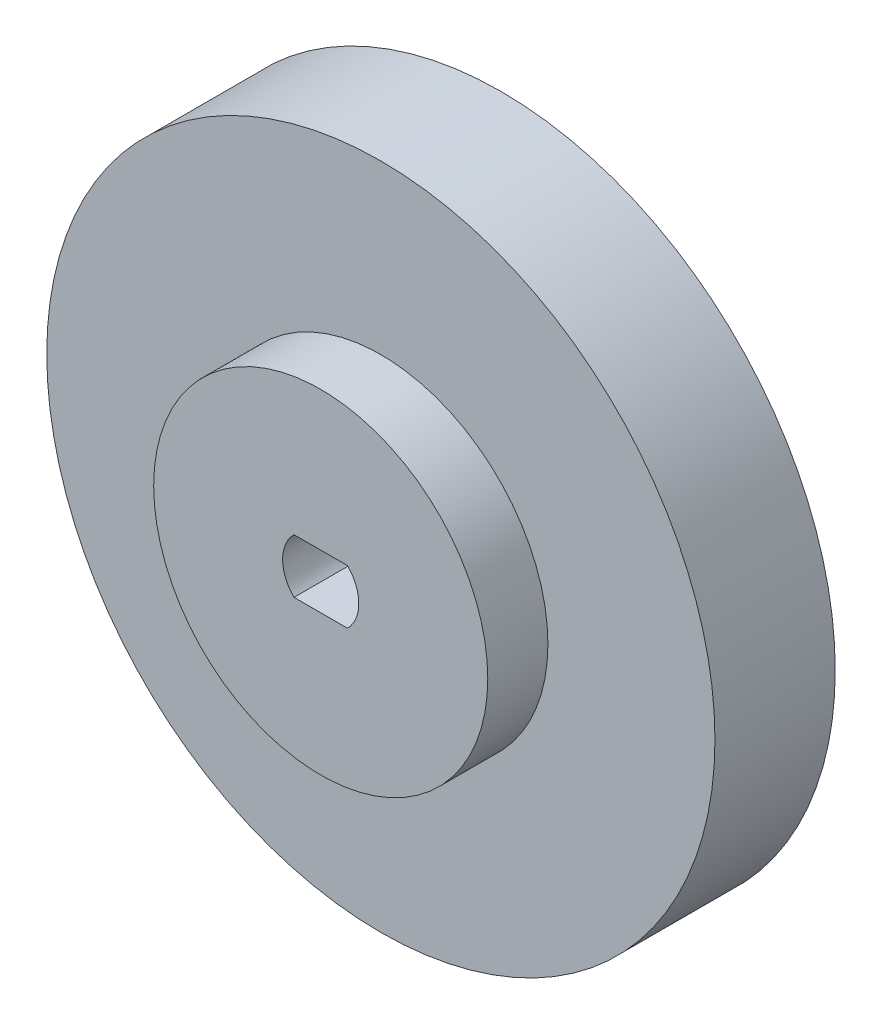
ISO-10303-21;
HEADER;
FILE_DESCRIPTION(('STEP AP214'),'2;1');
FILE_NAME('part.step','',(''),(''),'','','');
FILE_SCHEMA(('AUTOMOTIVE_DESIGN { 1 0 10303 214 1 1 1 1 }'));
ENDSEC;
DATA;
#1=APPLICATION_CONTEXT('core data for automotive mechanical design processes');
#2=APPLICATION_PROTOCOL_DEFINITION('international standard','automotive_design',2000,#1);
#3=PRODUCT_CONTEXT('',#1,'mechanical');
#4=PRODUCT('Part','Part','',(#3));
#5=PRODUCT_RELATED_PRODUCT_CATEGORY('part','',(#4));
#6=PRODUCT_DEFINITION_FORMATION('','',#4);
#7=PRODUCT_DEFINITION_CONTEXT('part definition',#1,'design');
#8=PRODUCT_DEFINITION('design','',#6,#7);
#9=PRODUCT_DEFINITION_SHAPE('','',#8);
#10=(LENGTH_UNIT() NAMED_UNIT(*) SI_UNIT(.MILLI.,.METRE.));
#11=(NAMED_UNIT(*) PLANE_ANGLE_UNIT() SI_UNIT($,.RADIAN.));
#12=(NAMED_UNIT(*) SI_UNIT($,.STERADIAN.) SOLID_ANGLE_UNIT());
#13=UNCERTAINTY_MEASURE_WITH_UNIT(LENGTH_MEASURE(1.E-05),#10,'distance_accuracy_value','');
#14=(GEOMETRIC_REPRESENTATION_CONTEXT(3) GLOBAL_UNCERTAINTY_ASSIGNED_CONTEXT((#13)) GLOBAL_UNIT_ASSIGNED_CONTEXT((#10,
#11,#12)) REPRESENTATION_CONTEXT('',''));
#15=CARTESIAN_POINT('',(0.,0.,0.));
#16=DIRECTION('',(0.,0.,1.));
#17=DIRECTION('',(1.,0.,0.));
#18=AXIS2_PLACEMENT_3D('',#15,#16,#17);
#19=CARTESIAN_POINT('',(0.,-0.0490461176635244,18.));
#20=DIRECTION('',(0.,0.,-1.));
#21=DIRECTION('',(-1.,0.,0.));
#22=AXIS2_PLACEMENT_3D('',#19,#20,#21);
#23=CYLINDRICAL_SURFACE('',#22,12.5);
#24=CARTESIAN_POINT('',(0.,-0.0490461176635244,0.));
#25=DIRECTION('',(0.,0.,1.));
#26=DIRECTION('',(1.,0.,0.));
#27=AXIS2_PLACEMENT_3D('',#24,#25,#26);
#28=CIRCLE('',#27,12.5);
#29=CARTESIAN_POINT('',(12.5,-0.0490461176635244,0.));
#30=VERTEX_POINT('',#29);
#31=EDGE_CURVE('E141',#30,#30,#28,.T.);
#32=ORIENTED_EDGE('',*,*,#31,.T.);
#33=EDGE_LOOP('',(#32));
#34=FACE_BOUND('',#33,.T.);
#35=CARTESIAN_POINT('',(0.,-0.0490461176635244,4.5));
#36=DIRECTION('',(0.,0.,1.));
#37=DIRECTION('',(1.,0.,0.));
#38=AXIS2_PLACEMENT_3D('',#35,#36,#37);
#39=CIRCLE('',#38,12.5);
#40=CARTESIAN_POINT('',(12.5,-0.0490461176635244,4.5));
#41=VERTEX_POINT('',#40);
#42=EDGE_CURVE('E11',#41,#41,#39,.T.);
#43=ORIENTED_EDGE('',*,*,#42,.F.);
#44=EDGE_LOOP('',(#43));
#45=FACE_BOUND('',#44,.T.);
#46=ADVANCED_FACE('F39',(#34,#45),#23,.T.);
#47=CARTESIAN_POINT('',(0.,-0.0490461176635244,0.));
#48=DIRECTION('',(0.,0.,1.));
#49=DIRECTION('',(1.,0.,0.));
#50=AXIS2_PLACEMENT_3D('',#47,#48,#49);
#51=PLANE('',#50);
#52=DIRECTION('',(-1.,0.,0.));
#53=VECTOR('',#52,1.);
#54=CARTESIAN_POINT('',(-2.,2.0303940504247,0.));
#55=LINE('',#54,#53);
#56=CARTESIAN_POINT('',(2.,2.0303940504247,0.));
#57=VERTEX_POINT('',#56);
#58=CARTESIAN_POINT('',(-2.,2.0303940504247,0.));
#59=VERTEX_POINT('',#58);
#60=EDGE_CURVE('E90',#57,#59,#55,.T.);
#61=ORIENTED_EDGE('',*,*,#60,.T.);
#62=CARTESIAN_POINT('',(0.,0.,0.));
#63=DIRECTION('',(0.,0.,1.));
#64=DIRECTION('',(1.,0.,0.));
#65=AXIS2_PLACEMENT_3D('',#62,#63,#64);
#66=CIRCLE('',#65,2.85);
#67=CARTESIAN_POINT('',(-2.,-2.0303940504247,0.));
#68=VERTEX_POINT('',#67);
#69=EDGE_CURVE('E83',#59,#68,#66,.T.);
#70=ORIENTED_EDGE('',*,*,#69,.T.);
#71=DIRECTION('',(1.,0.,0.));
#72=VECTOR('',#71,1.);
#73=CARTESIAN_POINT('',(-2.,-2.0303940504247,0.));
#74=LINE('',#73,#72);
#75=CARTESIAN_POINT('',(2.,-2.0303940504247,0.));
#76=VERTEX_POINT('',#75);
#77=EDGE_CURVE('E93',#68,#76,#74,.T.);
#78=ORIENTED_EDGE('',*,*,#77,.T.);
#79=CARTESIAN_POINT('',(0.,0.,0.));
#80=DIRECTION('',(0.,0.,1.));
#81=DIRECTION('',(1.,0.,0.));
#82=AXIS2_PLACEMENT_3D('',#79,#80,#81);
#83=CIRCLE('',#82,2.85);
#84=EDGE_CURVE('E55',#76,#57,#83,.T.);
#85=ORIENTED_EDGE('',*,*,#84,.T.);
#86=EDGE_LOOP('',(#61,#70,#78,#85));
#87=FACE_BOUND('',#86,.T.);
#88=ORIENTED_EDGE('',*,*,#31,.F.);
#89=EDGE_LOOP('',(#88));
#90=FACE_BOUND('',#89,.T.);
#91=ADVANCED_FACE('F98',(#87,#90),#51,.F.);
#92=CARTESIAN_POINT('',(0.,0.,4.5));
#93=DIRECTION('',(0.,0.,1.));
#94=DIRECTION('',(1.,0.,0.));
#95=AXIS2_PLACEMENT_3D('',#92,#93,#94);
#96=CYLINDRICAL_SURFACE('',#95,25.);
#97=CARTESIAN_POINT('',(0.,0.,4.5));
#98=DIRECTION('',(0.,0.,1.));
#99=DIRECTION('',(1.,0.,0.));
#100=AXIS2_PLACEMENT_3D('',#97,#98,#99);
#101=CIRCLE('',#100,25.);
#102=CARTESIAN_POINT('',(25.,0.,4.5));
#103=VERTEX_POINT('',#102);
#104=EDGE_CURVE('E130',#103,#103,#101,.T.);
#105=ORIENTED_EDGE('',*,*,#104,.T.);
#106=EDGE_LOOP('',(#105));
#107=FACE_BOUND('',#106,.T.);
#108=CARTESIAN_POINT('',(0.,0.,13.5));
#109=DIRECTION('',(0.,0.,1.));
#110=DIRECTION('',(1.,0.,0.));
#111=AXIS2_PLACEMENT_3D('',#108,#109,#110);
#112=CIRCLE('',#111,25.);
#113=CARTESIAN_POINT('',(25.,0.,13.5));
#114=VERTEX_POINT('',#113);
#115=EDGE_CURVE('E124',#114,#114,#112,.T.);
#116=ORIENTED_EDGE('',*,*,#115,.F.);
#117=EDGE_LOOP('',(#116));
#118=FACE_BOUND('',#117,.T.);
#119=ADVANCED_FACE('F158',(#107,#118),#96,.T.);
#120=CARTESIAN_POINT('',(0.,0.,4.5));
#121=DIRECTION('',(0.,0.,1.));
#122=DIRECTION('',(1.,0.,0.));
#123=AXIS2_PLACEMENT_3D('',#120,#121,#122);
#124=PLANE('',#123);
#125=ORIENTED_EDGE('',*,*,#42,.T.);
#126=EDGE_LOOP('',(#125));
#127=FACE_BOUND('',#126,.T.);
#128=ORIENTED_EDGE('',*,*,#104,.F.);
#129=EDGE_LOOP('',(#128));
#130=FACE_BOUND('',#129,.T.);
#131=ADVANCED_FACE('F154',(#127,#130),#124,.F.);
#132=CARTESIAN_POINT('',(0.,0.,13.5));
#133=DIRECTION('',(0.,0.,1.));
#134=DIRECTION('',(1.,0.,0.));
#135=AXIS2_PLACEMENT_3D('',#132,#133,#134);
#136=PLANE('',#135);
#137=CARTESIAN_POINT('',(0.,-0.0490461176635244,13.5));
#138=DIRECTION('',(0.,0.,1.));
#139=DIRECTION('',(1.,0.,0.));
#140=AXIS2_PLACEMENT_3D('',#137,#138,#139);
#141=CIRCLE('',#140,12.5);
#142=CARTESIAN_POINT('',(12.5,-0.0490461176635244,13.5));
#143=VERTEX_POINT('',#142);
#144=EDGE_CURVE('E134',#143,#143,#141,.T.);
#145=ORIENTED_EDGE('',*,*,#144,.F.);
#146=EDGE_LOOP('',(#145));
#147=FACE_BOUND('',#146,.T.);
#148=ORIENTED_EDGE('',*,*,#115,.T.);
#149=EDGE_LOOP('',(#148));
#150=FACE_BOUND('',#149,.T.);
#151=ADVANCED_FACE('F150',(#147,#150),#136,.T.);
#152=CARTESIAN_POINT('',(0.,-0.0490461176635244,18.));
#153=DIRECTION('',(0.,0.,1.));
#154=DIRECTION('',(1.,0.,0.));
#155=AXIS2_PLACEMENT_3D('',#152,#153,#154);
#156=PLANE('',#155);
#157=CARTESIAN_POINT('',(0.,0.,18.));
#158=DIRECTION('',(0.,0.,1.));
#159=DIRECTION('',(1.,0.,0.));
#160=AXIS2_PLACEMENT_3D('',#157,#158,#159);
#161=CIRCLE('',#160,2.85);
#162=CARTESIAN_POINT('',(-2.,2.0303940504247,18.));
#163=VERTEX_POINT('',#162);
#164=CARTESIAN_POINT('',(-2.,-2.0303940504247,18.));
#165=VERTEX_POINT('',#164);
#166=EDGE_CURVE('E63',#163,#165,#161,.T.);
#167=ORIENTED_EDGE('',*,*,#166,.F.);
#168=DIRECTION('',(-1.,0.,0.));
#169=VECTOR('',#168,1.);
#170=CARTESIAN_POINT('',(-2.,2.0303940504247,18.));
#171=LINE('',#170,#169);
#172=CARTESIAN_POINT('',(2.,2.0303940504247,18.));
#173=VERTEX_POINT('',#172);
#174=EDGE_CURVE('E102',#173,#163,#171,.T.);
#175=ORIENTED_EDGE('',*,*,#174,.F.);
#176=CARTESIAN_POINT('',(0.,0.,18.));
#177=DIRECTION('',(0.,0.,1.));
#178=DIRECTION('',(1.,0.,0.));
#179=AXIS2_PLACEMENT_3D('',#176,#177,#178);
#180=CIRCLE('',#179,2.85);
#181=CARTESIAN_POINT('',(2.,-2.0303940504247,18.));
#182=VERTEX_POINT('',#181);
#183=EDGE_CURVE('E106',#182,#173,#180,.T.);
#184=ORIENTED_EDGE('',*,*,#183,.F.);
#185=DIRECTION('',(1.,0.,0.));
#186=VECTOR('',#185,1.);
#187=CARTESIAN_POINT('',(-2.,-2.0303940504247,18.));
#188=LINE('',#187,#186);
#189=EDGE_CURVE('E115',#165,#182,#188,.T.);
#190=ORIENTED_EDGE('',*,*,#189,.F.);
#191=EDGE_LOOP('',(#167,#175,#184,#190));
#192=FACE_BOUND('',#191,.T.);
#193=CARTESIAN_POINT('',(0.,-0.0490461176635244,18.));
#194=DIRECTION('',(0.,0.,1.));
#195=DIRECTION('',(1.,0.,0.));
#196=AXIS2_PLACEMENT_3D('',#193,#194,#195);
#197=CIRCLE('',#196,12.5);
#198=CARTESIAN_POINT('',(12.5,-0.0490461176635244,18.));
#199=VERTEX_POINT('',#198);
#200=EDGE_CURVE('E48',#199,#199,#197,.T.);
#201=ORIENTED_EDGE('',*,*,#200,.T.);
#202=EDGE_LOOP('',(#201));
#203=FACE_BOUND('',#202,.T.);
#204=ADVANCED_FACE('F153',(#192,#203),#156,.T.);
#205=ORIENTED_EDGE('',*,*,#144,.T.);
#206=EDGE_LOOP('',(#205));
#207=FACE_BOUND('',#206,.T.);
#208=ORIENTED_EDGE('',*,*,#200,.F.);
#209=EDGE_LOOP('',(#208));
#210=FACE_BOUND('',#209,.T.);
#211=ADVANCED_FACE('F41',(#207,#210),#23,.T.);
#212=CARTESIAN_POINT('',(0.,0.,0.));
#213=DIRECTION('',(0.,0.,1.));
#214=DIRECTION('',(1.,0.,0.));
#215=AXIS2_PLACEMENT_3D('',#212,#213,#214);
#216=CYLINDRICAL_SURFACE('',#215,2.85);
#217=ORIENTED_EDGE('',*,*,#166,.T.);
#218=DIRECTION('',(0.,0.,1.));
#219=VECTOR('',#218,1.);
#220=CARTESIAN_POINT('',(-2.,-2.0303940504247,0.));
#221=LINE('',#220,#219);
#222=EDGE_CURVE('E79',#68,#165,#221,.T.);
#223=ORIENTED_EDGE('',*,*,#222,.F.);
#224=ORIENTED_EDGE('',*,*,#69,.F.);
#225=DIRECTION('',(0.,0.,1.));
#226=VECTOR('',#225,1.);
#227=CARTESIAN_POINT('',(-2.,2.0303940504247,0.));
#228=LINE('',#227,#226);
#229=EDGE_CURVE('E121',#59,#163,#228,.T.);
#230=ORIENTED_EDGE('',*,*,#229,.T.);
#231=EDGE_LOOP('',(#217,#223,#224,#230));
#232=FACE_BOUND('',#231,.T.);
#233=ADVANCED_FACE('F81',(#232),#216,.F.);
#234=CARTESIAN_POINT('',(-2.,2.0303940504247,0.));
#235=DIRECTION('',(0.,1.,0.));
#236=DIRECTION('',(0.,0.,1.));
#237=AXIS2_PLACEMENT_3D('',#234,#235,#236);
#238=PLANE('',#237);
#239=ORIENTED_EDGE('',*,*,#174,.T.);
#240=ORIENTED_EDGE('',*,*,#229,.F.);
#241=ORIENTED_EDGE('',*,*,#60,.F.);
#242=DIRECTION('',(0.,0.,1.));
#243=VECTOR('',#242,1.);
#244=CARTESIAN_POINT('',(2.,2.0303940504247,0.));
#245=LINE('',#244,#243);
#246=EDGE_CURVE('E125',#57,#173,#245,.T.);
#247=ORIENTED_EDGE('',*,*,#246,.T.);
#248=EDGE_LOOP('',(#239,#240,#241,#247));
#249=FACE_BOUND('',#248,.T.);
#250=ADVANCED_FACE('F179',(#249),#238,.F.);
#251=CARTESIAN_POINT('',(0.,0.,0.));
#252=DIRECTION('',(0.,0.,1.));
#253=DIRECTION('',(1.,0.,0.));
#254=AXIS2_PLACEMENT_3D('',#251,#252,#253);
#255=CYLINDRICAL_SURFACE('',#254,2.85);
#256=ORIENTED_EDGE('',*,*,#183,.T.);
#257=ORIENTED_EDGE('',*,*,#246,.F.);
#258=ORIENTED_EDGE('',*,*,#84,.F.);
#259=DIRECTION('',(0.,0.,1.));
#260=VECTOR('',#259,1.);
#261=CARTESIAN_POINT('',(2.,-2.0303940504247,0.));
#262=LINE('',#261,#260);
#263=EDGE_CURVE('E89',#76,#182,#262,.T.);
#264=ORIENTED_EDGE('',*,*,#263,.T.);
#265=EDGE_LOOP('',(#256,#257,#258,#264));
#266=FACE_BOUND('',#265,.T.);
#267=ADVANCED_FACE('F188',(#266),#255,.F.);
#268=CARTESIAN_POINT('',(-2.,-2.0303940504247,0.));
#269=DIRECTION('',(0.,-1.,0.));
#270=DIRECTION('',(0.,0.,-1.));
#271=AXIS2_PLACEMENT_3D('',#268,#269,#270);
#272=PLANE('',#271);
#273=ORIENTED_EDGE('',*,*,#189,.T.);
#274=ORIENTED_EDGE('',*,*,#263,.F.);
#275=ORIENTED_EDGE('',*,*,#77,.F.);
#276=ORIENTED_EDGE('',*,*,#222,.T.);
#277=EDGE_LOOP('',(#273,#274,#275,#276));
#278=FACE_BOUND('',#277,.T.);
#279=ADVANCED_FACE('F94',(#278),#272,.F.);
#280=CLOSED_SHELL('',(#46,#91,#119,#131,#151,#204,#211,#233,#250,#267,#279));
#281=MANIFOLD_SOLID_BREP('B2',#280);
#282=ADVANCED_BREP_SHAPE_REPRESENTATION('',(#18,#281),#14);
#283=SHAPE_DEFINITION_REPRESENTATION(#9,#282);
ENDSEC;
END-ISO-10303-21;
